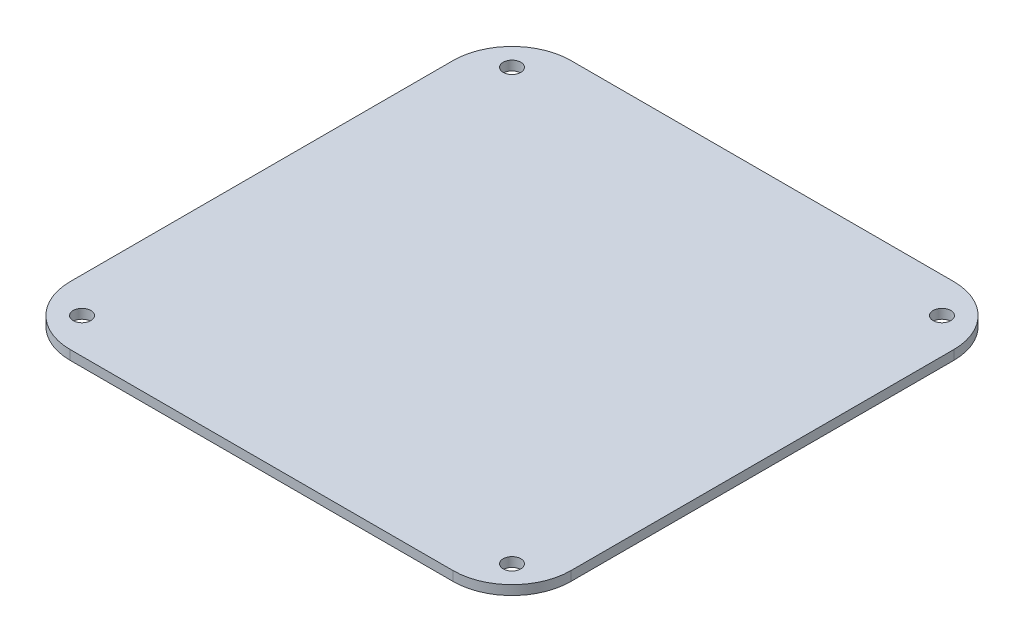
ISO-10303-21;
HEADER;
FILE_DESCRIPTION(('STEP AP214'),'2;1');
FILE_NAME('part.step','',(''),(''),'','','');
FILE_SCHEMA(('AUTOMOTIVE_DESIGN { 1 0 10303 214 1 1 1 1 }'));
ENDSEC;
DATA;
#1=APPLICATION_CONTEXT('core data for automotive mechanical design processes');
#2=APPLICATION_PROTOCOL_DEFINITION('international standard','automotive_design',2000,#1);
#3=PRODUCT_CONTEXT('',#1,'mechanical');
#4=PRODUCT('Part','Part','',(#3));
#5=PRODUCT_RELATED_PRODUCT_CATEGORY('part','',(#4));
#6=PRODUCT_DEFINITION_FORMATION('','',#4);
#7=PRODUCT_DEFINITION_CONTEXT('part definition',#1,'design');
#8=PRODUCT_DEFINITION('design','',#6,#7);
#9=PRODUCT_DEFINITION_SHAPE('','',#8);
#10=(LENGTH_UNIT() NAMED_UNIT(*) SI_UNIT(.MILLI.,.METRE.));
#11=(NAMED_UNIT(*) PLANE_ANGLE_UNIT() SI_UNIT($,.RADIAN.));
#12=(NAMED_UNIT(*) SI_UNIT($,.STERADIAN.) SOLID_ANGLE_UNIT());
#13=UNCERTAINTY_MEASURE_WITH_UNIT(LENGTH_MEASURE(1.E-05),#10,'distance_accuracy_value','');
#14=(GEOMETRIC_REPRESENTATION_CONTEXT(3) GLOBAL_UNCERTAINTY_ASSIGNED_CONTEXT((#13)) GLOBAL_UNIT_ASSIGNED_CONTEXT((#10,
#11,#12)) REPRESENTATION_CONTEXT('',''));
#15=CARTESIAN_POINT('',(0.,0.,0.));
#16=DIRECTION('',(0.,0.,1.));
#17=DIRECTION('',(1.,0.,0.));
#18=AXIS2_PLACEMENT_3D('',#15,#16,#17);
#19=CARTESIAN_POINT('',(0.,1.6,0.));
#20=DIRECTION('',(0.,-1.,0.));
#21=DIRECTION('',(0.,0.,-1.));
#22=AXIS2_PLACEMENT_3D('',#19,#20,#21);
#23=PLANE('',#22);
#24=DIRECTION('',(-1.,0.,0.));
#25=VECTOR('',#24,1.);
#26=CARTESIAN_POINT('',(0.,1.6,-85.));
#27=LINE('',#26,#25);
#28=CARTESIAN_POINT('',(75.,1.6,-85.));
#29=VERTEX_POINT('',#28);
#30=CARTESIAN_POINT('',(10.,1.6,-85.));
#31=VERTEX_POINT('',#30);
#32=EDGE_CURVE('E135',#29,#31,#27,.T.);
#33=ORIENTED_EDGE('',*,*,#32,.T.);
#34=CARTESIAN_POINT('',(10.,1.6,-75.));
#35=DIRECTION('',(0.,-1.,0.));
#36=DIRECTION('',(0.,0.,-1.));
#37=AXIS2_PLACEMENT_3D('',#34,#35,#36);
#38=CIRCLE('',#37,10.);
#39=CARTESIAN_POINT('',(0.,1.6,-75.));
#40=VERTEX_POINT('',#39);
#41=EDGE_CURVE('E154',#31,#40,#38,.F.);
#42=ORIENTED_EDGE('',*,*,#41,.T.);
#43=DIRECTION('',(0.,0.,1.));
#44=VECTOR('',#43,1.);
#45=CARTESIAN_POINT('',(0.,1.6,0.));
#46=LINE('',#45,#44);
#47=CARTESIAN_POINT('',(0.,1.6,-10.));
#48=VERTEX_POINT('',#47);
#49=EDGE_CURVE('E118',#40,#48,#46,.T.);
#50=ORIENTED_EDGE('',*,*,#49,.T.);
#51=CARTESIAN_POINT('',(10.,1.6,-10.));
#52=DIRECTION('',(0.,-1.,0.));
#53=DIRECTION('',(0.,0.,-1.));
#54=AXIS2_PLACEMENT_3D('',#51,#52,#53);
#55=CIRCLE('',#54,10.);
#56=CARTESIAN_POINT('',(10.,1.6,0.));
#57=VERTEX_POINT('',#56);
#58=EDGE_CURVE('E149',#48,#57,#55,.F.);
#59=ORIENTED_EDGE('',*,*,#58,.T.);
#60=DIRECTION('',(1.,0.,0.));
#61=VECTOR('',#60,1.);
#62=CARTESIAN_POINT('',(0.,1.6,0.));
#63=LINE('',#62,#61);
#64=CARTESIAN_POINT('',(75.,1.6,0.));
#65=VERTEX_POINT('',#64);
#66=EDGE_CURVE('E165',#57,#65,#63,.T.);
#67=ORIENTED_EDGE('',*,*,#66,.T.);
#68=CARTESIAN_POINT('',(75.,1.6,-10.));
#69=DIRECTION('',(0.,-1.,0.));
#70=DIRECTION('',(0.,0.,-1.));
#71=AXIS2_PLACEMENT_3D('',#68,#69,#70);
#72=CIRCLE('',#71,10.);
#73=CARTESIAN_POINT('',(85.,1.6,-10.));
#74=VERTEX_POINT('',#73);
#75=EDGE_CURVE('E54',#65,#74,#72,.F.);
#76=ORIENTED_EDGE('',*,*,#75,.T.);
#77=DIRECTION('',(0.,0.,-1.));
#78=VECTOR('',#77,1.);
#79=CARTESIAN_POINT('',(85.,1.6,0.));
#80=LINE('',#79,#78);
#81=CARTESIAN_POINT('',(85.,1.6,-75.));
#82=VERTEX_POINT('',#81);
#83=EDGE_CURVE('E173',#74,#82,#80,.T.);
#84=ORIENTED_EDGE('',*,*,#83,.T.);
#85=CARTESIAN_POINT('',(75.,1.6,-75.));
#86=DIRECTION('',(0.,-1.,0.));
#87=DIRECTION('',(0.,0.,-1.));
#88=AXIS2_PLACEMENT_3D('',#85,#86,#87);
#89=CIRCLE('',#88,10.);
#90=EDGE_CURVE('E152',#82,#29,#89,.F.);
#91=ORIENTED_EDGE('',*,*,#90,.T.);
#92=EDGE_LOOP('',(#33,#42,#50,#59,#67,#76,#84,#91));
#93=FACE_BOUND('',#92,.T.);
#94=CARTESIAN_POINT('',(6.,1.6,-79.));
#95=DIRECTION('',(0.,1.,0.));
#96=DIRECTION('',(0.,0.,1.));
#97=AXIS2_PLACEMENT_3D('',#94,#95,#96);
#98=CIRCLE('',#97,1.5);
#99=CARTESIAN_POINT('',(6.,1.6,-77.5));
#100=VERTEX_POINT('',#99);
#101=EDGE_CURVE('E126',#100,#100,#98,.T.);
#102=ORIENTED_EDGE('',*,*,#101,.F.);
#103=EDGE_LOOP('',(#102));
#104=FACE_BOUND('',#103,.T.);
#105=CARTESIAN_POINT('',(6.,1.6,-6.));
#106=DIRECTION('',(0.,1.,0.));
#107=DIRECTION('',(0.,0.,1.));
#108=AXIS2_PLACEMENT_3D('',#105,#106,#107);
#109=CIRCLE('',#108,1.5);
#110=CARTESIAN_POINT('',(6.,1.6,-4.5));
#111=VERTEX_POINT('',#110);
#112=EDGE_CURVE('E180',#111,#111,#109,.T.);
#113=ORIENTED_EDGE('',*,*,#112,.F.);
#114=EDGE_LOOP('',(#113));
#115=FACE_BOUND('',#114,.T.);
#116=CARTESIAN_POINT('',(79.,1.6,-6.));
#117=DIRECTION('',(0.,1.,0.));
#118=DIRECTION('',(0.,0.,1.));
#119=AXIS2_PLACEMENT_3D('',#116,#117,#118);
#120=CIRCLE('',#119,1.5);
#121=CARTESIAN_POINT('',(79.,1.6,-4.5));
#122=VERTEX_POINT('',#121);
#123=EDGE_CURVE('E185',#122,#122,#120,.T.);
#124=ORIENTED_EDGE('',*,*,#123,.F.);
#125=EDGE_LOOP('',(#124));
#126=FACE_BOUND('',#125,.T.);
#127=CARTESIAN_POINT('',(79.,1.6,-79.));
#128=DIRECTION('',(0.,1.,0.));
#129=DIRECTION('',(0.,0.,1.));
#130=AXIS2_PLACEMENT_3D('',#127,#128,#129);
#131=CIRCLE('',#130,1.5);
#132=CARTESIAN_POINT('',(79.,1.6,-77.5));
#133=VERTEX_POINT('',#132);
#134=EDGE_CURVE('E191',#133,#133,#131,.T.);
#135=ORIENTED_EDGE('',*,*,#134,.F.);
#136=EDGE_LOOP('',(#135));
#137=FACE_BOUND('',#136,.T.);
#138=ADVANCED_FACE('F32',(#93,#104,#115,#126,#137),#23,.F.);
#139=CARTESIAN_POINT('',(0.,0.,0.));
#140=DIRECTION('',(0.,-1.,0.));
#141=DIRECTION('',(0.,0.,-1.));
#142=AXIS2_PLACEMENT_3D('',#139,#140,#141);
#143=PLANE('',#142);
#144=CARTESIAN_POINT('',(79.,0.,-6.));
#145=DIRECTION('',(0.,1.,0.));
#146=DIRECTION('',(0.,0.,1.));
#147=AXIS2_PLACEMENT_3D('',#144,#145,#146);
#148=CIRCLE('',#147,1.5);
#149=CARTESIAN_POINT('',(79.,0.,-4.5));
#150=VERTEX_POINT('',#149);
#151=EDGE_CURVE('E188',#150,#150,#148,.T.);
#152=ORIENTED_EDGE('',*,*,#151,.T.);
#153=EDGE_LOOP('',(#152));
#154=FACE_BOUND('',#153,.T.);
#155=CARTESIAN_POINT('',(6.,0.,-79.));
#156=DIRECTION('',(0.,1.,0.));
#157=DIRECTION('',(0.,0.,1.));
#158=AXIS2_PLACEMENT_3D('',#155,#156,#157);
#159=CIRCLE('',#158,1.5);
#160=CARTESIAN_POINT('',(6.,0.,-77.5));
#161=VERTEX_POINT('',#160);
#162=EDGE_CURVE('E132',#161,#161,#159,.T.);
#163=ORIENTED_EDGE('',*,*,#162,.T.);
#164=EDGE_LOOP('',(#163));
#165=FACE_BOUND('',#164,.T.);
#166=DIRECTION('',(0.,0.,1.));
#167=VECTOR('',#166,1.);
#168=CARTESIAN_POINT('',(0.,0.,0.));
#169=LINE('',#168,#167);
#170=CARTESIAN_POINT('',(0.,0.,-75.));
#171=VERTEX_POINT('',#170);
#172=CARTESIAN_POINT('',(0.,0.,-10.));
#173=VERTEX_POINT('',#172);
#174=EDGE_CURVE('E115',#171,#173,#169,.T.);
#175=ORIENTED_EDGE('',*,*,#174,.F.);
#176=CARTESIAN_POINT('',(10.,0.,-75.));
#177=DIRECTION('',(0.,-1.,0.));
#178=DIRECTION('',(0.,0.,-1.));
#179=AXIS2_PLACEMENT_3D('',#176,#177,#178);
#180=CIRCLE('',#179,10.);
#181=CARTESIAN_POINT('',(10.,0.,-85.));
#182=VERTEX_POINT('',#181);
#183=EDGE_CURVE('E98',#171,#182,#180,.T.);
#184=ORIENTED_EDGE('',*,*,#183,.T.);
#185=DIRECTION('',(-1.,0.,0.));
#186=VECTOR('',#185,1.);
#187=CARTESIAN_POINT('',(0.,0.,-85.));
#188=LINE('',#187,#186);
#189=CARTESIAN_POINT('',(75.,0.,-85.));
#190=VERTEX_POINT('',#189);
#191=EDGE_CURVE('E139',#190,#182,#188,.T.);
#192=ORIENTED_EDGE('',*,*,#191,.F.);
#193=CARTESIAN_POINT('',(75.,0.,-75.));
#194=DIRECTION('',(0.,-1.,0.));
#195=DIRECTION('',(0.,0.,-1.));
#196=AXIS2_PLACEMENT_3D('',#193,#194,#195);
#197=CIRCLE('',#196,10.);
#198=CARTESIAN_POINT('',(85.,0.,-75.));
#199=VERTEX_POINT('',#198);
#200=EDGE_CURVE('E109',#190,#199,#197,.T.);
#201=ORIENTED_EDGE('',*,*,#200,.T.);
#202=DIRECTION('',(0.,0.,-1.));
#203=VECTOR('',#202,1.);
#204=CARTESIAN_POINT('',(85.,0.,0.));
#205=LINE('',#204,#203);
#206=CARTESIAN_POINT('',(85.,0.,-10.));
#207=VERTEX_POINT('',#206);
#208=EDGE_CURVE('E129',#207,#199,#205,.T.);
#209=ORIENTED_EDGE('',*,*,#208,.F.);
#210=CARTESIAN_POINT('',(75.,0.,-10.));
#211=DIRECTION('',(0.,-1.,0.));
#212=DIRECTION('',(0.,0.,-1.));
#213=AXIS2_PLACEMENT_3D('',#210,#211,#212);
#214=CIRCLE('',#213,10.);
#215=CARTESIAN_POINT('',(75.,0.,0.));
#216=VERTEX_POINT('',#215);
#217=EDGE_CURVE('E143',#207,#216,#214,.T.);
#218=ORIENTED_EDGE('',*,*,#217,.T.);
#219=DIRECTION('',(1.,0.,0.));
#220=VECTOR('',#219,1.);
#221=CARTESIAN_POINT('',(0.,0.,0.));
#222=LINE('',#221,#220);
#223=CARTESIAN_POINT('',(10.,0.,0.));
#224=VERTEX_POINT('',#223);
#225=EDGE_CURVE('E125',#224,#216,#222,.T.);
#226=ORIENTED_EDGE('',*,*,#225,.F.);
#227=CARTESIAN_POINT('',(10.,0.,-10.));
#228=DIRECTION('',(0.,-1.,0.));
#229=DIRECTION('',(0.,0.,-1.));
#230=AXIS2_PLACEMENT_3D('',#227,#228,#229);
#231=CIRCLE('',#230,10.);
#232=EDGE_CURVE('E119',#224,#173,#231,.T.);
#233=ORIENTED_EDGE('',*,*,#232,.T.);
#234=EDGE_LOOP('',(#175,#184,#192,#201,#209,#218,#226,#233));
#235=FACE_BOUND('',#234,.T.);
#236=CARTESIAN_POINT('',(6.,0.,-6.));
#237=DIRECTION('',(0.,1.,0.));
#238=DIRECTION('',(0.,0.,1.));
#239=AXIS2_PLACEMENT_3D('',#236,#237,#238);
#240=CIRCLE('',#239,1.5);
#241=CARTESIAN_POINT('',(6.,0.,-4.5));
#242=VERTEX_POINT('',#241);
#243=EDGE_CURVE('E182',#242,#242,#240,.T.);
#244=ORIENTED_EDGE('',*,*,#243,.T.);
#245=EDGE_LOOP('',(#244));
#246=FACE_BOUND('',#245,.T.);
#247=CARTESIAN_POINT('',(79.,0.,-79.));
#248=DIRECTION('',(0.,1.,0.));
#249=DIRECTION('',(0.,0.,1.));
#250=AXIS2_PLACEMENT_3D('',#247,#248,#249);
#251=CIRCLE('',#250,1.5);
#252=CARTESIAN_POINT('',(79.,0.,-77.5));
#253=VERTEX_POINT('',#252);
#254=EDGE_CURVE('E194',#253,#253,#251,.T.);
#255=ORIENTED_EDGE('',*,*,#254,.T.);
#256=EDGE_LOOP('',(#255));
#257=FACE_BOUND('',#256,.T.);
#258=ADVANCED_FACE('F122',(#154,#165,#235,#246,#257),#143,.T.);
#259=CARTESIAN_POINT('',(0.,1.6,0.));
#260=DIRECTION('',(1.,0.,0.));
#261=DIRECTION('',(0.,0.,-1.));
#262=AXIS2_PLACEMENT_3D('',#259,#260,#261);
#263=PLANE('',#262);
#264=ORIENTED_EDGE('',*,*,#49,.F.);
#265=DIRECTION('',(0.,-1.,0.));
#266=VECTOR('',#265,1.);
#267=CARTESIAN_POINT('',(0.,1.6,-75.));
#268=LINE('',#267,#266);
#269=EDGE_CURVE('E102',#40,#171,#268,.T.);
#270=ORIENTED_EDGE('',*,*,#269,.T.);
#271=ORIENTED_EDGE('',*,*,#174,.T.);
#272=DIRECTION('',(0.,-1.,0.));
#273=VECTOR('',#272,1.);
#274=CARTESIAN_POINT('',(0.,1.6,-10.));
#275=LINE('',#274,#273);
#276=EDGE_CURVE('E120',#173,#48,#275,.F.);
#277=ORIENTED_EDGE('',*,*,#276,.T.);
#278=EDGE_LOOP('',(#264,#270,#271,#277));
#279=FACE_BOUND('',#278,.T.);
#280=ADVANCED_FACE('F114',(#279),#263,.F.);
#281=CARTESIAN_POINT('',(0.,1.6,0.));
#282=DIRECTION('',(0.,0.,-1.));
#283=DIRECTION('',(-1.,0.,0.));
#284=AXIS2_PLACEMENT_3D('',#281,#282,#283);
#285=PLANE('',#284);
#286=ORIENTED_EDGE('',*,*,#225,.T.);
#287=DIRECTION('',(0.,-1.,0.));
#288=VECTOR('',#287,1.);
#289=CARTESIAN_POINT('',(75.,1.6,0.));
#290=LINE('',#289,#288);
#291=EDGE_CURVE('E11',#216,#65,#290,.F.);
#292=ORIENTED_EDGE('',*,*,#291,.T.);
#293=ORIENTED_EDGE('',*,*,#66,.F.);
#294=DIRECTION('',(0.,-1.,0.));
#295=VECTOR('',#294,1.);
#296=CARTESIAN_POINT('',(10.,1.6,0.));
#297=LINE('',#296,#295);
#298=EDGE_CURVE('E40',#57,#224,#297,.T.);
#299=ORIENTED_EDGE('',*,*,#298,.T.);
#300=EDGE_LOOP('',(#286,#292,#293,#299));
#301=FACE_BOUND('',#300,.T.);
#302=ADVANCED_FACE('F163',(#301),#285,.F.);
#303=CARTESIAN_POINT('',(85.,1.6,0.));
#304=DIRECTION('',(-1.,0.,0.));
#305=DIRECTION('',(0.,0.,1.));
#306=AXIS2_PLACEMENT_3D('',#303,#304,#305);
#307=PLANE('',#306);
#308=ORIENTED_EDGE('',*,*,#208,.T.);
#309=DIRECTION('',(0.,-1.,0.));
#310=VECTOR('',#309,1.);
#311=CARTESIAN_POINT('',(85.,1.6,-75.));
#312=LINE('',#311,#310);
#313=EDGE_CURVE('E47',#199,#82,#312,.F.);
#314=ORIENTED_EDGE('',*,*,#313,.T.);
#315=ORIENTED_EDGE('',*,*,#83,.F.);
#316=DIRECTION('',(0.,-1.,0.));
#317=VECTOR('',#316,1.);
#318=CARTESIAN_POINT('',(85.,1.6,-10.));
#319=LINE('',#318,#317);
#320=EDGE_CURVE('E156',#74,#207,#319,.T.);
#321=ORIENTED_EDGE('',*,*,#320,.T.);
#322=EDGE_LOOP('',(#308,#314,#315,#321));
#323=FACE_BOUND('',#322,.T.);
#324=ADVANCED_FACE('F172',(#323),#307,.F.);
#325=CARTESIAN_POINT('',(0.,1.6,-85.));
#326=DIRECTION('',(0.,0.,1.));
#327=DIRECTION('',(1.,0.,0.));
#328=AXIS2_PLACEMENT_3D('',#325,#326,#327);
#329=PLANE('',#328);
#330=ORIENTED_EDGE('',*,*,#191,.T.);
#331=DIRECTION('',(0.,-1.,0.));
#332=VECTOR('',#331,1.);
#333=CARTESIAN_POINT('',(10.,1.6,-85.));
#334=LINE('',#333,#332);
#335=EDGE_CURVE('E103',#182,#31,#334,.F.);
#336=ORIENTED_EDGE('',*,*,#335,.T.);
#337=ORIENTED_EDGE('',*,*,#32,.F.);
#338=DIRECTION('',(0.,-1.,0.));
#339=VECTOR('',#338,1.);
#340=CARTESIAN_POINT('',(75.,1.6,-85.));
#341=LINE('',#340,#339);
#342=EDGE_CURVE('E108',#29,#190,#341,.T.);
#343=ORIENTED_EDGE('',*,*,#342,.T.);
#344=EDGE_LOOP('',(#330,#336,#337,#343));
#345=FACE_BOUND('',#344,.T.);
#346=ADVANCED_FACE('F215',(#345),#329,.F.);
#347=CARTESIAN_POINT('',(6.,1.6,-79.));
#348=DIRECTION('',(0.,-1.,0.));
#349=DIRECTION('',(0.,0.,-1.));
#350=AXIS2_PLACEMENT_3D('',#347,#348,#349);
#351=CYLINDRICAL_SURFACE('',#350,1.5);
#352=ORIENTED_EDGE('',*,*,#101,.T.);
#353=EDGE_LOOP('',(#352));
#354=FACE_BOUND('',#353,.T.);
#355=ORIENTED_EDGE('',*,*,#162,.F.);
#356=EDGE_LOOP('',(#355));
#357=FACE_BOUND('',#356,.T.);
#358=ADVANCED_FACE('F212',(#354,#357),#351,.F.);
#359=CARTESIAN_POINT('',(6.,1.6,-6.));
#360=DIRECTION('',(0.,-1.,0.));
#361=DIRECTION('',(0.,0.,-1.));
#362=AXIS2_PLACEMENT_3D('',#359,#360,#361);
#363=CYLINDRICAL_SURFACE('',#362,1.5);
#364=ORIENTED_EDGE('',*,*,#112,.T.);
#365=EDGE_LOOP('',(#364));
#366=FACE_BOUND('',#365,.T.);
#367=ORIENTED_EDGE('',*,*,#243,.F.);
#368=EDGE_LOOP('',(#367));
#369=FACE_BOUND('',#368,.T.);
#370=ADVANCED_FACE('F308',(#366,#369),#363,.F.);
#371=CARTESIAN_POINT('',(79.,1.6,-6.));
#372=DIRECTION('',(0.,-1.,0.));
#373=DIRECTION('',(0.,0.,-1.));
#374=AXIS2_PLACEMENT_3D('',#371,#372,#373);
#375=CYLINDRICAL_SURFACE('',#374,1.5);
#376=ORIENTED_EDGE('',*,*,#123,.T.);
#377=EDGE_LOOP('',(#376));
#378=FACE_BOUND('',#377,.T.);
#379=ORIENTED_EDGE('',*,*,#151,.F.);
#380=EDGE_LOOP('',(#379));
#381=FACE_BOUND('',#380,.T.);
#382=ADVANCED_FACE('F299',(#378,#381),#375,.F.);
#383=CARTESIAN_POINT('',(79.,1.6,-79.));
#384=DIRECTION('',(0.,-1.,0.));
#385=DIRECTION('',(0.,0.,-1.));
#386=AXIS2_PLACEMENT_3D('',#383,#384,#385);
#387=CYLINDRICAL_SURFACE('',#386,1.5);
#388=ORIENTED_EDGE('',*,*,#134,.T.);
#389=EDGE_LOOP('',(#388));
#390=FACE_BOUND('',#389,.T.);
#391=ORIENTED_EDGE('',*,*,#254,.F.);
#392=EDGE_LOOP('',(#391));
#393=FACE_BOUND('',#392,.T.);
#394=ADVANCED_FACE('F200',(#390,#393),#387,.F.);
#395=CARTESIAN_POINT('',(10.,1.6,-75.));
#396=DIRECTION('',(0.,-1.,0.));
#397=DIRECTION('',(0.,0.,-1.));
#398=AXIS2_PLACEMENT_3D('',#395,#396,#397);
#399=CYLINDRICAL_SURFACE('',#398,10.);
#400=ORIENTED_EDGE('',*,*,#41,.F.);
#401=ORIENTED_EDGE('',*,*,#335,.F.);
#402=ORIENTED_EDGE('',*,*,#183,.F.);
#403=ORIENTED_EDGE('',*,*,#269,.F.);
#404=EDGE_LOOP('',(#400,#401,#402,#403));
#405=FACE_BOUND('',#404,.T.);
#406=ADVANCED_FACE('F101',(#405),#399,.T.);
#407=CARTESIAN_POINT('',(75.,1.6,-75.));
#408=DIRECTION('',(0.,-1.,0.));
#409=DIRECTION('',(0.,0.,-1.));
#410=AXIS2_PLACEMENT_3D('',#407,#408,#409);
#411=CYLINDRICAL_SURFACE('',#410,10.);
#412=ORIENTED_EDGE('',*,*,#90,.F.);
#413=ORIENTED_EDGE('',*,*,#313,.F.);
#414=ORIENTED_EDGE('',*,*,#200,.F.);
#415=ORIENTED_EDGE('',*,*,#342,.F.);
#416=EDGE_LOOP('',(#412,#413,#414,#415));
#417=FACE_BOUND('',#416,.T.);
#418=ADVANCED_FACE('F227',(#417),#411,.T.);
#419=CARTESIAN_POINT('',(75.,1.6,-10.));
#420=DIRECTION('',(0.,-1.,0.));
#421=DIRECTION('',(0.,0.,-1.));
#422=AXIS2_PLACEMENT_3D('',#419,#420,#421);
#423=CYLINDRICAL_SURFACE('',#422,10.);
#424=ORIENTED_EDGE('',*,*,#75,.F.);
#425=ORIENTED_EDGE('',*,*,#291,.F.);
#426=ORIENTED_EDGE('',*,*,#217,.F.);
#427=ORIENTED_EDGE('',*,*,#320,.F.);
#428=EDGE_LOOP('',(#424,#425,#426,#427));
#429=FACE_BOUND('',#428,.T.);
#430=ADVANCED_FACE('F171',(#429),#423,.T.);
#431=CARTESIAN_POINT('',(10.,1.6,-10.));
#432=DIRECTION('',(0.,-1.,0.));
#433=DIRECTION('',(0.,0.,-1.));
#434=AXIS2_PLACEMENT_3D('',#431,#432,#433);
#435=CYLINDRICAL_SURFACE('',#434,10.);
#436=ORIENTED_EDGE('',*,*,#58,.F.);
#437=ORIENTED_EDGE('',*,*,#276,.F.);
#438=ORIENTED_EDGE('',*,*,#232,.F.);
#439=ORIENTED_EDGE('',*,*,#298,.F.);
#440=EDGE_LOOP('',(#436,#437,#438,#439));
#441=FACE_BOUND('',#440,.T.);
#442=ADVANCED_FACE('F34',(#441),#435,.T.);
#443=CLOSED_SHELL('',(#138,#258,#280,#302,#324,#346,#358,#370,#382,#394,#406,#418,#430,#442));
#444=MANIFOLD_SOLID_BREP('B2',#443);
#445=ADVANCED_BREP_SHAPE_REPRESENTATION('',(#18,#444),#14);
#446=SHAPE_DEFINITION_REPRESENTATION(#9,#445);
ENDSEC;
END-ISO-10303-21;
